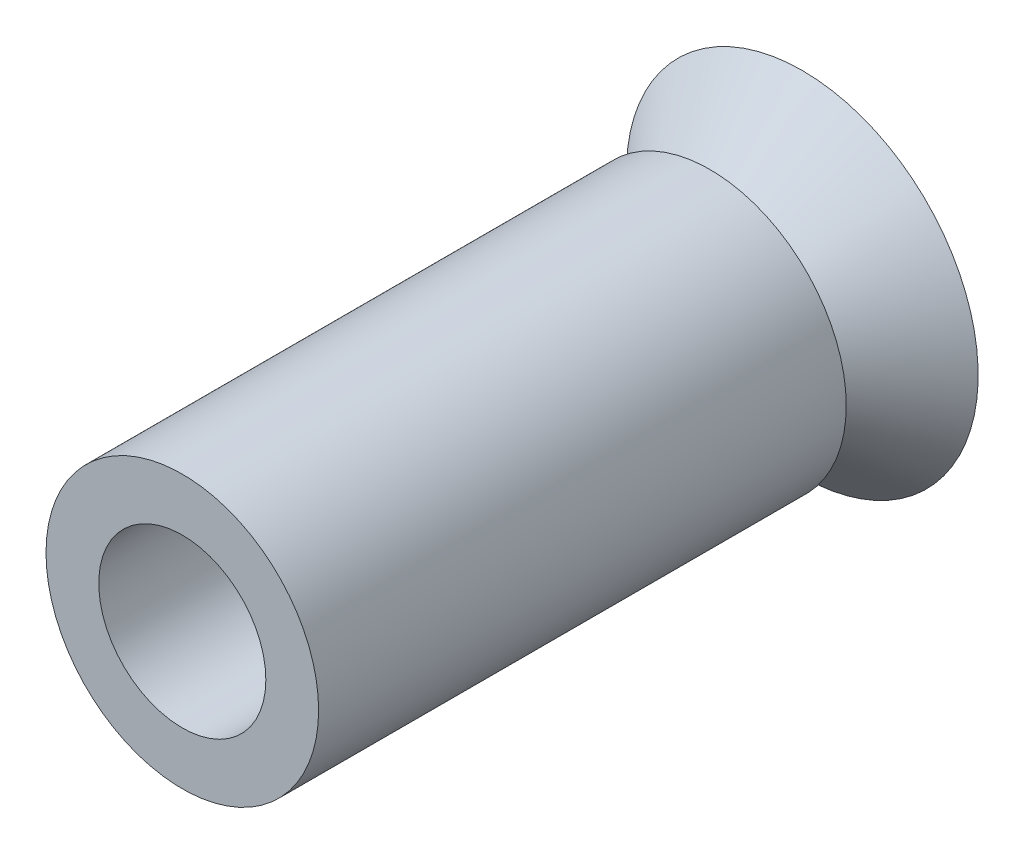
ISO-10303-21;
HEADER;
FILE_DESCRIPTION(('STEP AP214'),'2;1');
FILE_NAME('part.step','',(''),(''),'','','');
FILE_SCHEMA(('AUTOMOTIVE_DESIGN { 1 0 10303 214 1 1 1 1 }'));
ENDSEC;
DATA;
#1=APPLICATION_CONTEXT('core data for automotive mechanical design processes');
#2=APPLICATION_PROTOCOL_DEFINITION('international standard','automotive_design',2000,#1);
#3=PRODUCT_CONTEXT('',#1,'mechanical');
#4=PRODUCT('Part','Part','',(#3));
#5=PRODUCT_RELATED_PRODUCT_CATEGORY('part','',(#4));
#6=PRODUCT_DEFINITION_FORMATION('','',#4);
#7=PRODUCT_DEFINITION_CONTEXT('part definition',#1,'design');
#8=PRODUCT_DEFINITION('design','',#6,#7);
#9=PRODUCT_DEFINITION_SHAPE('','',#8);
#10=(LENGTH_UNIT() NAMED_UNIT(*) SI_UNIT(.MILLI.,.METRE.));
#11=(NAMED_UNIT(*) PLANE_ANGLE_UNIT() SI_UNIT($,.RADIAN.));
#12=(NAMED_UNIT(*) SI_UNIT($,.STERADIAN.) SOLID_ANGLE_UNIT());
#13=UNCERTAINTY_MEASURE_WITH_UNIT(LENGTH_MEASURE(1.E-05),#10,'distance_accuracy_value','');
#14=(GEOMETRIC_REPRESENTATION_CONTEXT(3) GLOBAL_UNCERTAINTY_ASSIGNED_CONTEXT((#13)) GLOBAL_UNIT_ASSIGNED_CONTEXT((#10,
#11,#12)) REPRESENTATION_CONTEXT('',''));
#15=CARTESIAN_POINT('',(0.,0.,0.));
#16=DIRECTION('',(0.,0.,1.));
#17=DIRECTION('',(1.,0.,0.));
#18=AXIS2_PLACEMENT_3D('',#15,#16,#17);
#19=CARTESIAN_POINT('',(0.,0.,7.05));
#20=DIRECTION('',(0.,0.,1.));
#21=DIRECTION('',(1.,0.,0.));
#22=AXIS2_PLACEMENT_3D('',#19,#20,#21);
#23=PLANE('',#22);
#24=CARTESIAN_POINT('',(0.,0.,7.05));
#25=DIRECTION('',(0.,0.,1.));
#26=DIRECTION('',(1.,0.,0.));
#27=AXIS2_PLACEMENT_3D('',#24,#25,#26);
#28=CIRCLE('',#27,1.55);
#29=CARTESIAN_POINT('',(1.55,0.,7.05));
#30=VERTEX_POINT('',#29);
#31=EDGE_CURVE('E11',#30,#30,#28,.T.);
#32=ORIENTED_EDGE('',*,*,#31,.T.);
#33=EDGE_LOOP('',(#32));
#34=FACE_BOUND('',#33,.T.);
#35=CARTESIAN_POINT('',(0.,0.,7.05));
#36=DIRECTION('',(0.,0.,1.));
#37=DIRECTION('',(1.,0.,0.));
#38=AXIS2_PLACEMENT_3D('',#35,#36,#37);
#39=CIRCLE('',#38,0.95);
#40=CARTESIAN_POINT('',(0.95,0.,7.05));
#41=VERTEX_POINT('',#40);
#42=EDGE_CURVE('E51',#41,#41,#39,.T.);
#43=ORIENTED_EDGE('',*,*,#42,.F.);
#44=EDGE_LOOP('',(#43));
#45=FACE_BOUND('',#44,.T.);
#46=ADVANCED_FACE('F40',(#34,#45),#23,.T.);
#47=CARTESIAN_POINT('',(0.,0.,1.05));
#48=DIRECTION('',(0.,0.,1.));
#49=DIRECTION('',(1.,0.,0.));
#50=AXIS2_PLACEMENT_3D('',#47,#48,#49);
#51=PLANE('',#50);
#52=CARTESIAN_POINT('',(0.,0.,1.05));
#53=DIRECTION('',(0.,0.,1.));
#54=DIRECTION('',(1.,0.,0.));
#55=AXIS2_PLACEMENT_3D('',#52,#53,#54);
#56=CIRCLE('',#55,1.55);
#57=CARTESIAN_POINT('',(1.55,0.,1.05));
#58=VERTEX_POINT('',#57);
#59=EDGE_CURVE('E44',#58,#58,#56,.T.);
#60=ORIENTED_EDGE('',*,*,#59,.F.);
#61=EDGE_LOOP('',(#60));
#62=FACE_BOUND('',#61,.T.);
#63=CARTESIAN_POINT('',(0.,0.,1.05));
#64=DIRECTION('',(0.,0.,1.));
#65=DIRECTION('',(1.,0.,0.));
#66=AXIS2_PLACEMENT_3D('',#63,#64,#65);
#67=CIRCLE('',#66,0.95);
#68=CARTESIAN_POINT('',(0.95,0.,1.05));
#69=VERTEX_POINT('',#68);
#70=EDGE_CURVE('E53',#69,#69,#67,.T.);
#71=ORIENTED_EDGE('',*,*,#70,.T.);
#72=EDGE_LOOP('',(#71));
#73=FACE_BOUND('',#72,.T.);
#74=ADVANCED_FACE('F63',(#62,#73),#51,.F.);
#75=CARTESIAN_POINT('',(0.,0.,7.05));
#76=DIRECTION('',(0.,0.,-1.));
#77=DIRECTION('',(-1.,0.,0.));
#78=AXIS2_PLACEMENT_3D('',#75,#76,#77);
#79=CYLINDRICAL_SURFACE('',#78,1.55);
#80=ORIENTED_EDGE('',*,*,#31,.F.);
#81=EDGE_LOOP('',(#80));
#82=FACE_BOUND('',#81,.T.);
#83=ORIENTED_EDGE('',*,*,#59,.T.);
#84=EDGE_LOOP('',(#83));
#85=FACE_BOUND('',#84,.T.);
#86=ADVANCED_FACE('F42',(#82,#85),#79,.T.);
#87=CARTESIAN_POINT('',(0.,0.,7.05));
#88=DIRECTION('',(0.,0.,-1.));
#89=DIRECTION('',(-1.,0.,0.));
#90=AXIS2_PLACEMENT_3D('',#87,#88,#89);
#91=CYLINDRICAL_SURFACE('',#90,0.95);
#92=ORIENTED_EDGE('',*,*,#42,.T.);
#93=EDGE_LOOP('',(#92));
#94=FACE_BOUND('',#93,.T.);
#95=ORIENTED_EDGE('',*,*,#70,.F.);
#96=EDGE_LOOP('',(#95));
#97=FACE_BOUND('',#96,.T.);
#98=ADVANCED_FACE('F59',(#94,#97),#91,.F.);
#99=CLOSED_SHELL('',(#46,#74,#86,#98));
#100=MANIFOLD_SOLID_BREP('B2',#99);
#101=CARTESIAN_POINT('',(0.,0.,0.));
#102=DIRECTION('',(0.,0.,-1.));
#103=DIRECTION('',(0.,1.,0.));
#104=AXIS2_PLACEMENT_3D('',#101,#102,#103);
#105=PLANE('',#104);
#106=CARTESIAN_POINT('',(0.,0.,0.));
#107=DIRECTION('',(0.,0.,-1.));
#108=DIRECTION('',(0.,1.,0.));
#109=AXIS2_PLACEMENT_3D('',#106,#107,#108);
#110=CIRCLE('',#109,2.);
#111=CARTESIAN_POINT('',(0.,2.,0.));
#112=VERTEX_POINT('',#111);
#113=EDGE_CURVE('E39',#112,#112,#110,.T.);
#114=ORIENTED_EDGE('',*,*,#113,.T.);
#115=EDGE_LOOP('',(#114));
#116=FACE_BOUND('',#115,.T.);
#117=ADVANCED_FACE('F101',(#116),#105,.T.);
#118=CARTESIAN_POINT('',(0.,0.,0.));
#119=DIRECTION('',(0.,0.,-1.));
#120=DIRECTION('',(0.,1.,0.));
#121=AXIS2_PLACEMENT_3D('',#118,#119,#120);
#122=CONICAL_SURFACE('',#121,2.,0.785398163397447);
#123=CARTESIAN_POINT('',(0.,0.,1.05));
#124=DIRECTION('',(0.,0.,1.));
#125=DIRECTION('',(0.,-1.,0.));
#126=AXIS2_PLACEMENT_3D('',#123,#124,#125);
#127=CIRCLE('',#126,0.95);
#128=CARTESIAN_POINT('',(0.,-0.95,1.05));
#129=VERTEX_POINT('',#128);
#130=EDGE_CURVE('E107',#129,#129,#127,.T.);
#131=ORIENTED_EDGE('',*,*,#130,.F.);
#132=EDGE_LOOP('',(#131));
#133=FACE_BOUND('',#132,.T.);
#134=ORIENTED_EDGE('',*,*,#113,.F.);
#135=EDGE_LOOP('',(#134));
#136=FACE_BOUND('',#135,.T.);
#137=ADVANCED_FACE('F126',(#133,#136),#122,.T.);
#138=CARTESIAN_POINT('',(0.,0.,3.));
#139=DIRECTION('',(0.,0.,-1.));
#140=DIRECTION('',(-1.,0.,0.));
#141=AXIS2_PLACEMENT_3D('',#138,#139,#140);
#142=CYLINDRICAL_SURFACE('',#141,0.95);
#143=ORIENTED_EDGE('',*,*,#130,.T.);
#144=EDGE_LOOP('',(#143));
#145=FACE_BOUND('',#144,.T.);
#146=CARTESIAN_POINT('',(0.,0.,3.));
#147=DIRECTION('',(0.,0.,-1.));
#148=DIRECTION('',(0.,1.,0.));
#149=AXIS2_PLACEMENT_3D('',#146,#147,#148);
#150=CIRCLE('',#149,0.95);
#151=CARTESIAN_POINT('',(0.,0.95,3.));
#152=VERTEX_POINT('',#151);
#153=EDGE_CURVE('E111',#152,#152,#150,.T.);
#154=ORIENTED_EDGE('',*,*,#153,.T.);
#155=EDGE_LOOP('',(#154));
#156=FACE_BOUND('',#155,.T.);
#157=ADVANCED_FACE('F118',(#145,#156),#142,.T.);
#158=CARTESIAN_POINT('',(0.,0.,3.));
#159=DIRECTION('',(0.,0.,-1.));
#160=DIRECTION('',(0.,1.,0.));
#161=AXIS2_PLACEMENT_3D('',#158,#159,#160);
#162=PLANE('',#161);
#163=ORIENTED_EDGE('',*,*,#153,.F.);
#164=EDGE_LOOP('',(#163));
#165=FACE_BOUND('',#164,.T.);
#166=ADVANCED_FACE('F120',(#165),#162,.F.);
#167=CLOSED_SHELL('',(#117,#137,#157,#166));
#168=MANIFOLD_SOLID_BREP('B6',#167);
#169=ADVANCED_BREP_SHAPE_REPRESENTATION('',(#18,#100,#168),#14);
#170=SHAPE_DEFINITION_REPRESENTATION(#9,#169);
ENDSEC;
END-ISO-10303-21;
